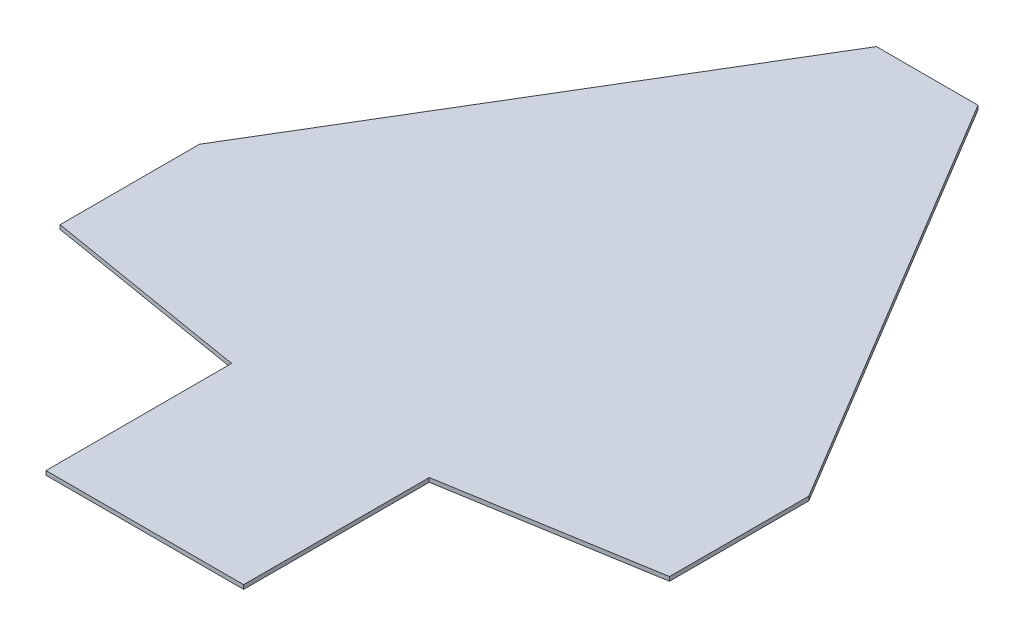
ISO-10303-21;
HEADER;
FILE_DESCRIPTION(('STEP AP214'),'2;1');
FILE_NAME('part.step','',(''),(''),'','','');
FILE_SCHEMA(('AUTOMOTIVE_DESIGN { 1 0 10303 214 1 1 1 1 }'));
ENDSEC;
DATA;
#1=APPLICATION_CONTEXT('core data for automotive mechanical design processes');
#2=APPLICATION_PROTOCOL_DEFINITION('international standard','automotive_design',2000,#1);
#3=PRODUCT_CONTEXT('',#1,'mechanical');
#4=PRODUCT('Part','Part','',(#3));
#5=PRODUCT_RELATED_PRODUCT_CATEGORY('part','',(#4));
#6=PRODUCT_DEFINITION_FORMATION('','',#4);
#7=PRODUCT_DEFINITION_CONTEXT('part definition',#1,'design');
#8=PRODUCT_DEFINITION('design','',#6,#7);
#9=PRODUCT_DEFINITION_SHAPE('','',#8);
#10=(LENGTH_UNIT() NAMED_UNIT(*) SI_UNIT(.MILLI.,.METRE.));
#11=(NAMED_UNIT(*) PLANE_ANGLE_UNIT() SI_UNIT($,.RADIAN.));
#12=(NAMED_UNIT(*) SI_UNIT($,.STERADIAN.) SOLID_ANGLE_UNIT());
#13=UNCERTAINTY_MEASURE_WITH_UNIT(LENGTH_MEASURE(1.E-05),#10,'distance_accuracy_value','');
#14=(GEOMETRIC_REPRESENTATION_CONTEXT(3) GLOBAL_UNCERTAINTY_ASSIGNED_CONTEXT((#13)) GLOBAL_UNIT_ASSIGNED_CONTEXT((#10,
#11,#12)) REPRESENTATION_CONTEXT('',''));
#15=CARTESIAN_POINT('',(0.,0.,0.));
#16=DIRECTION('',(0.,0.,1.));
#17=DIRECTION('',(1.,0.,0.));
#18=AXIS2_PLACEMENT_3D('',#15,#16,#17);
#19=CARTESIAN_POINT('',(-37.5430295129392,2.54,400.386363558214));
#20=DIRECTION('',(0.,0.,-1.));
#21=DIRECTION('',(-1.,0.,0.));
#22=AXIS2_PLACEMENT_3D('',#19,#20,#21);
#23=PLANE('',#22);
#24=DIRECTION('',(1.,0.,0.));
#25=VECTOR('',#24,1.);
#26=CARTESIAN_POINT('',(-37.5430295129392,0.,400.386363558214));
#27=LINE('',#26,#25);
#28=CARTESIAN_POINT('',(-37.5430295129392,0.,400.386363558214));
#29=VERTEX_POINT('',#28);
#30=CARTESIAN_POINT('',(84.3769704870607,0.,400.386363558214));
#31=VERTEX_POINT('',#30);
#32=EDGE_CURVE('E140',#29,#31,#27,.T.);
#33=ORIENTED_EDGE('',*,*,#32,.T.);
#34=DIRECTION('',(0.,-1.,0.));
#35=VECTOR('',#34,1.);
#36=CARTESIAN_POINT('',(84.3769704870607,2.54,400.386363558214));
#37=LINE('',#36,#35);
#38=CARTESIAN_POINT('',(84.3769704870607,2.54,400.386363558214));
#39=VERTEX_POINT('',#38);
#40=EDGE_CURVE('E11',#39,#31,#37,.T.);
#41=ORIENTED_EDGE('',*,*,#40,.F.);
#42=DIRECTION('',(1.,0.,0.));
#43=VECTOR('',#42,1.);
#44=CARTESIAN_POINT('',(-37.5430295129392,2.54,400.386363558214));
#45=LINE('',#44,#43);
#46=CARTESIAN_POINT('',(-37.5430295129392,2.54,400.386363558214));
#47=VERTEX_POINT('',#46);
#48=EDGE_CURVE('E158',#47,#39,#45,.T.);
#49=ORIENTED_EDGE('',*,*,#48,.F.);
#50=DIRECTION('',(0.,-1.,0.));
#51=VECTOR('',#50,1.);
#52=CARTESIAN_POINT('',(-37.5430295129392,2.54,400.386363558214));
#53=LINE('',#52,#51);
#54=EDGE_CURVE('E136',#47,#29,#53,.T.);
#55=ORIENTED_EDGE('',*,*,#54,.T.);
#56=EDGE_LOOP('',(#33,#41,#49,#55));
#57=FACE_BOUND('',#56,.T.);
#58=ADVANCED_FACE('F32',(#57),#23,.F.);
#59=CARTESIAN_POINT('',(84.3769704870607,2.54,400.386363558214));
#60=DIRECTION('',(-1.,0.,0.));
#61=DIRECTION('',(0.,0.,1.));
#62=AXIS2_PLACEMENT_3D('',#59,#60,#61);
#63=PLANE('',#62);
#64=DIRECTION('',(0.,0.,-1.));
#65=VECTOR('',#64,1.);
#66=CARTESIAN_POINT('',(84.3769704870607,0.,400.386363558214));
#67=LINE('',#66,#65);
#68=CARTESIAN_POINT('',(84.3769704870607,0.,285.910409438027));
#69=VERTEX_POINT('',#68);
#70=EDGE_CURVE('E143',#31,#69,#67,.T.);
#71=ORIENTED_EDGE('',*,*,#70,.T.);
#72=DIRECTION('',(0.,-1.,0.));
#73=VECTOR('',#72,1.);
#74=CARTESIAN_POINT('',(84.3769704870607,2.54,285.910409438027));
#75=LINE('',#74,#73);
#76=CARTESIAN_POINT('',(84.3769704870607,2.54,285.910409438027));
#77=VERTEX_POINT('',#76);
#78=EDGE_CURVE('E40',#77,#69,#75,.T.);
#79=ORIENTED_EDGE('',*,*,#78,.F.);
#80=DIRECTION('',(0.,0.,-1.));
#81=VECTOR('',#80,1.);
#82=CARTESIAN_POINT('',(84.3769704870607,2.54,400.386363558214));
#83=LINE('',#82,#81);
#84=EDGE_CURVE('E97',#39,#77,#83,.T.);
#85=ORIENTED_EDGE('',*,*,#84,.F.);
#86=ORIENTED_EDGE('',*,*,#40,.T.);
#87=EDGE_LOOP('',(#71,#79,#85,#86));
#88=FACE_BOUND('',#87,.T.);
#89=ADVANCED_FACE('F207',(#88),#63,.F.);
#90=CARTESIAN_POINT('',(211.376970487061,2.54,264.696747554312));
#91=DIRECTION('',(-0.164754096556276,0.,-0.986334673256459));
#92=DIRECTION('',(-0.986334673256459,0.,0.164754096556276));
#93=AXIS2_PLACEMENT_3D('',#90,#91,#92);
#94=PLANE('',#93);
#95=DIRECTION('',(0.986334673256459,0.,-0.164754096556276));
#96=VECTOR('',#95,1.);
#97=CARTESIAN_POINT('',(211.376970487061,0.,264.696747554312));
#98=LINE('',#97,#96);
#99=CARTESIAN_POINT('',(211.376970487061,0.,264.696747554312));
#100=VERTEX_POINT('',#99);
#101=EDGE_CURVE('E145',#69,#100,#98,.T.);
#102=ORIENTED_EDGE('',*,*,#101,.T.);
#103=DIRECTION('',(0.,-1.,0.));
#104=VECTOR('',#103,1.);
#105=CARTESIAN_POINT('',(211.376970487061,2.54,264.696747554312));
#106=LINE('',#105,#104);
#107=CARTESIAN_POINT('',(211.376970487061,2.54,264.696747554312));
#108=VERTEX_POINT('',#107);
#109=EDGE_CURVE('E171',#108,#100,#106,.T.);
#110=ORIENTED_EDGE('',*,*,#109,.F.);
#111=DIRECTION('',(0.986334673256459,0.,-0.164754096556276));
#112=VECTOR('',#111,1.);
#113=CARTESIAN_POINT('',(211.376970487061,2.54,264.696747554312));
#114=LINE('',#113,#112);
#115=EDGE_CURVE('E179',#77,#108,#114,.T.);
#116=ORIENTED_EDGE('',*,*,#115,.F.);
#117=ORIENTED_EDGE('',*,*,#78,.T.);
#118=EDGE_LOOP('',(#102,#110,#116,#117));
#119=FACE_BOUND('',#118,.T.);
#120=ADVANCED_FACE('F177',(#119),#94,.F.);
#121=CARTESIAN_POINT('',(211.376970487061,2.54,178.766701674499));
#122=DIRECTION('',(-1.,0.,0.));
#123=DIRECTION('',(0.,0.,1.));
#124=AXIS2_PLACEMENT_3D('',#121,#122,#123);
#125=PLANE('',#124);
#126=DIRECTION('',(0.,0.,-1.));
#127=VECTOR('',#126,1.);
#128=CARTESIAN_POINT('',(211.376970487061,0.,178.766701674499));
#129=LINE('',#128,#127);
#130=CARTESIAN_POINT('',(211.376970487061,0.,178.766701674499));
#131=VERTEX_POINT('',#130);
#132=EDGE_CURVE('E147',#100,#131,#129,.T.);
#133=ORIENTED_EDGE('',*,*,#132,.T.);
#134=DIRECTION('',(0.,-1.,0.));
#135=VECTOR('',#134,1.);
#136=CARTESIAN_POINT('',(211.376970487061,2.54,178.766701674499));
#137=LINE('',#136,#135);
#138=CARTESIAN_POINT('',(211.376970487061,2.54,178.766701674499));
#139=VERTEX_POINT('',#138);
#140=EDGE_CURVE('E168',#139,#131,#137,.T.);
#141=ORIENTED_EDGE('',*,*,#140,.F.);
#142=DIRECTION('',(0.,0.,-1.));
#143=VECTOR('',#142,1.);
#144=CARTESIAN_POINT('',(211.376970487061,2.54,178.766701674499));
#145=LINE('',#144,#143);
#146=EDGE_CURVE('E197',#108,#139,#145,.T.);
#147=ORIENTED_EDGE('',*,*,#146,.F.);
#148=ORIENTED_EDGE('',*,*,#109,.T.);
#149=EDGE_LOOP('',(#133,#141,#147,#148));
#150=FACE_BOUND('',#149,.T.);
#151=ADVANCED_FACE('F188',(#150),#125,.F.);
#152=CARTESIAN_POINT('',(54.7539934560281,2.54,-82.213636441786));
#153=DIRECTION('',(-0.857442517454998,0.,0.514579759862779));
#154=DIRECTION('',(0.514579759862779,0.,0.857442517454998));
#155=AXIS2_PLACEMENT_3D('',#152,#153,#154);
#156=PLANE('',#155);
#157=DIRECTION('',(-0.514579759862779,0.,-0.857442517454998));
#158=VECTOR('',#157,1.);
#159=CARTESIAN_POINT('',(54.7539934560281,0.,-82.213636441786));
#160=LINE('',#159,#158);
#161=CARTESIAN_POINT('',(54.7539934560281,0.,-82.213636441786));
#162=VERTEX_POINT('',#161);
#163=EDGE_CURVE('E149',#131,#162,#160,.T.);
#164=ORIENTED_EDGE('',*,*,#163,.T.);
#165=DIRECTION('',(0.,-1.,0.));
#166=VECTOR('',#165,1.);
#167=CARTESIAN_POINT('',(54.7539934560281,2.54,-82.213636441786));
#168=LINE('',#167,#166);
#169=CARTESIAN_POINT('',(54.7539934560281,2.54,-82.213636441786));
#170=VERTEX_POINT('',#169);
#171=EDGE_CURVE('E165',#170,#162,#168,.T.);
#172=ORIENTED_EDGE('',*,*,#171,.F.);
#173=DIRECTION('',(-0.514579759862779,0.,-0.857442517454998));
#174=VECTOR('',#173,1.);
#175=CARTESIAN_POINT('',(54.7539934560281,2.54,-82.213636441786));
#176=LINE('',#175,#174);
#177=EDGE_CURVE('E194',#139,#170,#176,.T.);
#178=ORIENTED_EDGE('',*,*,#177,.F.);
#179=ORIENTED_EDGE('',*,*,#140,.T.);
#180=EDGE_LOOP('',(#164,#172,#178,#179));
#181=FACE_BOUND('',#180,.T.);
#182=ADVANCED_FACE('F192',(#181),#156,.F.);
#183=CARTESIAN_POINT('',(54.7539934560281,2.54,-82.213636441786));
#184=DIRECTION('',(0.,0.,1.));
#185=DIRECTION('',(1.,0.,0.));
#186=AXIS2_PLACEMENT_3D('',#183,#184,#185);
#187=PLANE('',#186);
#188=DIRECTION('',(-1.,0.,0.));
#189=VECTOR('',#188,1.);
#190=CARTESIAN_POINT('',(54.7539934560281,0.,-82.213636441786));
#191=LINE('',#190,#189);
#192=CARTESIAN_POINT('',(-7.92005248190649,0.,-82.213636441786));
#193=VERTEX_POINT('',#192);
#194=EDGE_CURVE('E151',#162,#193,#191,.T.);
#195=ORIENTED_EDGE('',*,*,#194,.T.);
#196=DIRECTION('',(0.,-1.,0.));
#197=VECTOR('',#196,1.);
#198=CARTESIAN_POINT('',(-7.92005248190649,2.54,-82.213636441786));
#199=LINE('',#198,#197);
#200=CARTESIAN_POINT('',(-7.92005248190649,2.54,-82.213636441786));
#201=VERTEX_POINT('',#200);
#202=EDGE_CURVE('E162',#201,#193,#199,.T.);
#203=ORIENTED_EDGE('',*,*,#202,.F.);
#204=DIRECTION('',(-1.,0.,0.));
#205=VECTOR('',#204,1.);
#206=CARTESIAN_POINT('',(54.7539934560281,2.54,-82.213636441786));
#207=LINE('',#206,#205);
#208=EDGE_CURVE('E196',#170,#201,#207,.T.);
#209=ORIENTED_EDGE('',*,*,#208,.F.);
#210=ORIENTED_EDGE('',*,*,#171,.T.);
#211=EDGE_LOOP('',(#195,#203,#209,#210));
#212=FACE_BOUND('',#211,.T.);
#213=ADVANCED_FACE('F219',(#212),#187,.F.);
#214=CARTESIAN_POINT('',(-7.92005248190649,2.54,-82.213636441786));
#215=DIRECTION('',(0.857442517454988,0.,0.514579759862795));
#216=DIRECTION('',(0.514579759862795,0.,-0.857442517454989));
#217=AXIS2_PLACEMENT_3D('',#214,#215,#216);
#218=PLANE('',#217);
#219=DIRECTION('',(-0.514579759862795,0.,0.857442517454988));
#220=VECTOR('',#219,1.);
#221=CARTESIAN_POINT('',(-7.92005248190649,0.,-82.213636441786));
#222=LINE('',#221,#220);
#223=CARTESIAN_POINT('',(-164.543029512937,0.,178.766701674484));
#224=VERTEX_POINT('',#223);
#225=EDGE_CURVE('E153',#193,#224,#222,.T.);
#226=ORIENTED_EDGE('',*,*,#225,.T.);
#227=DIRECTION('',(0.,-1.,0.));
#228=VECTOR('',#227,1.);
#229=CARTESIAN_POINT('',(-164.543029512937,2.54,178.766701674484));
#230=LINE('',#229,#228);
#231=CARTESIAN_POINT('',(-164.543029512937,2.54,178.766701674484));
#232=VERTEX_POINT('',#231);
#233=EDGE_CURVE('E131',#232,#224,#230,.T.);
#234=ORIENTED_EDGE('',*,*,#233,.F.);
#235=DIRECTION('',(-0.514579759862795,0.,0.857442517454988));
#236=VECTOR('',#235,1.);
#237=CARTESIAN_POINT('',(-7.92005248190649,2.54,-82.213636441786));
#238=LINE('',#237,#236);
#239=EDGE_CURVE('E122',#201,#232,#238,.T.);
#240=ORIENTED_EDGE('',*,*,#239,.F.);
#241=ORIENTED_EDGE('',*,*,#202,.T.);
#242=EDGE_LOOP('',(#226,#234,#240,#241));
#243=FACE_BOUND('',#242,.T.);
#244=ADVANCED_FACE('F222',(#243),#218,.F.);
#245=CARTESIAN_POINT('',(-164.543029512937,2.54,178.766701674484));
#246=DIRECTION('',(1.,0.,0.));
#247=DIRECTION('',(0.,0.,-1.));
#248=AXIS2_PLACEMENT_3D('',#245,#246,#247);
#249=PLANE('',#248);
#250=DIRECTION('',(0.,0.,1.));
#251=VECTOR('',#250,1.);
#252=CARTESIAN_POINT('',(-164.543029512937,0.,178.766701674484));
#253=LINE('',#252,#251);
#254=CARTESIAN_POINT('',(-164.543029512937,0.,264.696747554299));
#255=VERTEX_POINT('',#254);
#256=EDGE_CURVE('E130',#224,#255,#253,.T.);
#257=ORIENTED_EDGE('',*,*,#256,.T.);
#258=DIRECTION('',(0.,-1.,0.));
#259=VECTOR('',#258,1.);
#260=CARTESIAN_POINT('',(-164.543029512937,2.54,264.696747554299));
#261=LINE('',#260,#259);
#262=CARTESIAN_POINT('',(-164.543029512937,2.54,264.696747554299));
#263=VERTEX_POINT('',#262);
#264=EDGE_CURVE('E127',#263,#255,#261,.T.);
#265=ORIENTED_EDGE('',*,*,#264,.F.);
#266=DIRECTION('',(0.,0.,1.));
#267=VECTOR('',#266,1.);
#268=CARTESIAN_POINT('',(-164.543029512937,2.54,178.766701674484));
#269=LINE('',#268,#267);
#270=EDGE_CURVE('E116',#232,#263,#269,.T.);
#271=ORIENTED_EDGE('',*,*,#270,.F.);
#272=ORIENTED_EDGE('',*,*,#233,.T.);
#273=EDGE_LOOP('',(#257,#265,#271,#272));
#274=FACE_BOUND('',#273,.T.);
#275=ADVANCED_FACE('F128',(#274),#249,.F.);
#276=CARTESIAN_POINT('',(-164.543029512937,2.54,264.696747554299));
#277=DIRECTION('',(0.164754096556375,0.,-0.986334673256442));
#278=DIRECTION('',(-0.986334673256442,0.,-0.164754096556375));
#279=AXIS2_PLACEMENT_3D('',#276,#277,#278);
#280=PLANE('',#279);
#281=DIRECTION('',(0.986334673256442,0.,0.164754096556375));
#282=VECTOR('',#281,1.);
#283=CARTESIAN_POINT('',(-164.543029512937,0.,264.696747554299));
#284=LINE('',#283,#282);
#285=CARTESIAN_POINT('',(-37.5430295129392,0.,285.910409438027));
#286=VERTEX_POINT('',#285);
#287=EDGE_CURVE('E83',#255,#286,#284,.T.);
#288=ORIENTED_EDGE('',*,*,#287,.T.);
#289=DIRECTION('',(0.,-1.,0.));
#290=VECTOR('',#289,1.);
#291=CARTESIAN_POINT('',(-37.5430295129392,2.54,285.910409438027));
#292=LINE('',#291,#290);
#293=CARTESIAN_POINT('',(-37.5430295129392,2.54,285.910409438027));
#294=VERTEX_POINT('',#293);
#295=EDGE_CURVE('E132',#294,#286,#292,.T.);
#296=ORIENTED_EDGE('',*,*,#295,.F.);
#297=DIRECTION('',(0.986334673256442,0.,0.164754096556375));
#298=VECTOR('',#297,1.);
#299=CARTESIAN_POINT('',(-164.543029512937,2.54,264.696747554299));
#300=LINE('',#299,#298);
#301=EDGE_CURVE('E120',#263,#294,#300,.T.);
#302=ORIENTED_EDGE('',*,*,#301,.F.);
#303=ORIENTED_EDGE('',*,*,#264,.T.);
#304=EDGE_LOOP('',(#288,#296,#302,#303));
#305=FACE_BOUND('',#304,.T.);
#306=ADVANCED_FACE('F134',(#305),#280,.F.);
#307=CARTESIAN_POINT('',(-37.5430295129392,2.54,285.910409438027));
#308=DIRECTION('',(1.,0.,0.));
#309=DIRECTION('',(0.,0.,-1.));
#310=AXIS2_PLACEMENT_3D('',#307,#308,#309);
#311=PLANE('',#310);
#312=DIRECTION('',(0.,0.,1.));
#313=VECTOR('',#312,1.);
#314=CARTESIAN_POINT('',(-37.5430295129392,0.,285.910409438027));
#315=LINE('',#314,#313);
#316=EDGE_CURVE('E89',#286,#29,#315,.T.);
#317=ORIENTED_EDGE('',*,*,#316,.T.);
#318=ORIENTED_EDGE('',*,*,#54,.F.);
#319=DIRECTION('',(0.,0.,1.));
#320=VECTOR('',#319,1.);
#321=CARTESIAN_POINT('',(-37.5430295129392,2.54,285.910409438027));
#322=LINE('',#321,#320);
#323=EDGE_CURVE('E48',#294,#47,#322,.T.);
#324=ORIENTED_EDGE('',*,*,#323,.F.);
#325=ORIENTED_EDGE('',*,*,#295,.T.);
#326=EDGE_LOOP('',(#317,#318,#324,#325));
#327=FACE_BOUND('',#326,.T.);
#328=ADVANCED_FACE('F231',(#327),#311,.F.);
#329=CARTESIAN_POINT('',(0.,2.54,0.));
#330=DIRECTION('',(0.,1.,0.));
#331=DIRECTION('',(0.,0.,1.));
#332=AXIS2_PLACEMENT_3D('',#329,#330,#331);
#333=PLANE('',#332);
#334=ORIENTED_EDGE('',*,*,#48,.T.);
#335=ORIENTED_EDGE('',*,*,#84,.T.);
#336=ORIENTED_EDGE('',*,*,#115,.T.);
#337=ORIENTED_EDGE('',*,*,#146,.T.);
#338=ORIENTED_EDGE('',*,*,#177,.T.);
#339=ORIENTED_EDGE('',*,*,#208,.T.);
#340=ORIENTED_EDGE('',*,*,#239,.T.);
#341=ORIENTED_EDGE('',*,*,#270,.T.);
#342=ORIENTED_EDGE('',*,*,#301,.T.);
#343=ORIENTED_EDGE('',*,*,#323,.T.);
#344=EDGE_LOOP('',(#334,#335,#336,#337,#338,#339,#340,#341,#342,#343));
#345=FACE_BOUND('',#344,.T.);
#346=ADVANCED_FACE('F118',(#345),#333,.T.);
#347=CARTESIAN_POINT('',(0.,0.,0.));
#348=DIRECTION('',(0.,1.,0.));
#349=DIRECTION('',(0.,0.,1.));
#350=AXIS2_PLACEMENT_3D('',#347,#348,#349);
#351=PLANE('',#350);
#352=ORIENTED_EDGE('',*,*,#32,.F.);
#353=ORIENTED_EDGE('',*,*,#316,.F.);
#354=ORIENTED_EDGE('',*,*,#287,.F.);
#355=ORIENTED_EDGE('',*,*,#256,.F.);
#356=ORIENTED_EDGE('',*,*,#225,.F.);
#357=ORIENTED_EDGE('',*,*,#194,.F.);
#358=ORIENTED_EDGE('',*,*,#163,.F.);
#359=ORIENTED_EDGE('',*,*,#132,.F.);
#360=ORIENTED_EDGE('',*,*,#101,.F.);
#361=ORIENTED_EDGE('',*,*,#70,.F.);
#362=EDGE_LOOP('',(#352,#353,#354,#355,#356,#357,#358,#359,#360,#361));
#363=FACE_BOUND('',#362,.T.);
#364=ADVANCED_FACE('F183',(#363),#351,.F.);
#365=CLOSED_SHELL('',(#58,#89,#120,#151,#182,#213,#244,#275,#306,#328,#346,#364));
#366=MANIFOLD_SOLID_BREP('B2',#365);
#367=ADVANCED_BREP_SHAPE_REPRESENTATION('',(#18,#366),#14);
#368=SHAPE_DEFINITION_REPRESENTATION(#9,#367);
ENDSEC;
END-ISO-10303-21;
